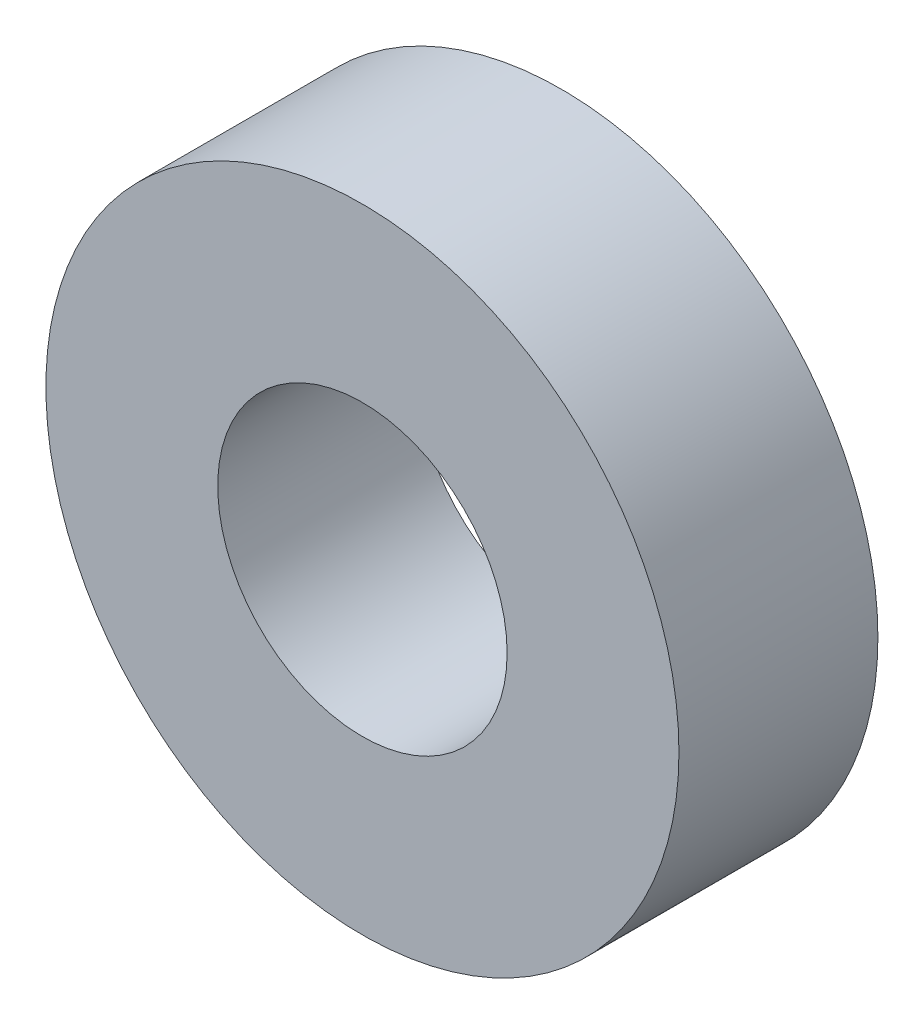
ISO-10303-21;
HEADER;
FILE_DESCRIPTION(('STEP AP214'),'2;1');
FILE_NAME('part.step','',(''),(''),'','','');
FILE_SCHEMA(('AUTOMOTIVE_DESIGN { 1 0 10303 214 1 1 1 1 }'));
ENDSEC;
DATA;
#1=APPLICATION_CONTEXT('core data for automotive mechanical design processes');
#2=APPLICATION_PROTOCOL_DEFINITION('international standard','automotive_design',2000,#1);
#3=PRODUCT_CONTEXT('',#1,'mechanical');
#4=PRODUCT('Part','Part','',(#3));
#5=PRODUCT_RELATED_PRODUCT_CATEGORY('part','',(#4));
#6=PRODUCT_DEFINITION_FORMATION('','',#4);
#7=PRODUCT_DEFINITION_CONTEXT('part definition',#1,'design');
#8=PRODUCT_DEFINITION('design','',#6,#7);
#9=PRODUCT_DEFINITION_SHAPE('','',#8);
#10=(LENGTH_UNIT() NAMED_UNIT(*) SI_UNIT(.MILLI.,.METRE.));
#11=(NAMED_UNIT(*) PLANE_ANGLE_UNIT() SI_UNIT($,.RADIAN.));
#12=(NAMED_UNIT(*) SI_UNIT($,.STERADIAN.) SOLID_ANGLE_UNIT());
#13=UNCERTAINTY_MEASURE_WITH_UNIT(LENGTH_MEASURE(1.E-05),#10,'distance_accuracy_value','');
#14=(GEOMETRIC_REPRESENTATION_CONTEXT(3) GLOBAL_UNCERTAINTY_ASSIGNED_CONTEXT((#13)) GLOBAL_UNIT_ASSIGNED_CONTEXT((#10,
#11,#12)) REPRESENTATION_CONTEXT('',''));
#15=CARTESIAN_POINT('',(0.,0.,0.));
#16=DIRECTION('',(0.,0.,1.));
#17=DIRECTION('',(1.,0.,0.));
#18=AXIS2_PLACEMENT_3D('',#15,#16,#17);
#19=CARTESIAN_POINT('',(0.,0.,11.));
#20=DIRECTION('',(0.,0.,1.));
#21=DIRECTION('',(1.,0.,0.));
#22=AXIS2_PLACEMENT_3D('',#19,#20,#21);
#23=PLANE('',#22);
#24=CARTESIAN_POINT('',(0.,0.,11.));
#25=DIRECTION('',(0.,0.,1.));
#26=DIRECTION('',(1.,0.,0.));
#27=AXIS2_PLACEMENT_3D('',#24,#25,#26);
#28=CIRCLE('',#27,17.5);
#29=CARTESIAN_POINT('',(17.5,0.,11.));
#30=VERTEX_POINT('',#29);
#31=EDGE_CURVE('E10',#30,#30,#28,.T.);
#32=ORIENTED_EDGE('',*,*,#31,.T.);
#33=EDGE_LOOP('',(#32));
#34=FACE_BOUND('',#33,.T.);
#35=CARTESIAN_POINT('',(0.,0.,11.));
#36=DIRECTION('',(0.,0.,1.));
#37=DIRECTION('',(1.,0.,0.));
#38=AXIS2_PLACEMENT_3D('',#35,#36,#37);
#39=CIRCLE('',#38,8.);
#40=CARTESIAN_POINT('',(8.,0.,11.));
#41=VERTEX_POINT('',#40);
#42=EDGE_CURVE('E42',#41,#41,#39,.T.);
#43=ORIENTED_EDGE('',*,*,#42,.F.);
#44=EDGE_LOOP('',(#43));
#45=FACE_BOUND('',#44,.T.);
#46=ADVANCED_FACE('F31',(#34,#45),#23,.T.);
#47=CARTESIAN_POINT('',(0.,0.,0.));
#48=DIRECTION('',(0.,0.,1.));
#49=DIRECTION('',(1.,0.,0.));
#50=AXIS2_PLACEMENT_3D('',#47,#48,#49);
#51=PLANE('',#50);
#52=CARTESIAN_POINT('',(0.,0.,0.));
#53=DIRECTION('',(0.,0.,1.));
#54=DIRECTION('',(1.,0.,0.));
#55=AXIS2_PLACEMENT_3D('',#52,#53,#54);
#56=CIRCLE('',#55,17.5);
#57=CARTESIAN_POINT('',(17.5,0.,0.));
#58=VERTEX_POINT('',#57);
#59=EDGE_CURVE('E35',#58,#58,#56,.T.);
#60=ORIENTED_EDGE('',*,*,#59,.F.);
#61=EDGE_LOOP('',(#60));
#62=FACE_BOUND('',#61,.T.);
#63=CARTESIAN_POINT('',(0.,0.,0.));
#64=DIRECTION('',(0.,0.,1.));
#65=DIRECTION('',(1.,0.,0.));
#66=AXIS2_PLACEMENT_3D('',#63,#64,#65);
#67=CIRCLE('',#66,8.);
#68=CARTESIAN_POINT('',(8.,0.,0.));
#69=VERTEX_POINT('',#68);
#70=EDGE_CURVE('E44',#69,#69,#67,.T.);
#71=ORIENTED_EDGE('',*,*,#70,.T.);
#72=EDGE_LOOP('',(#71));
#73=FACE_BOUND('',#72,.T.);
#74=ADVANCED_FACE('F54',(#62,#73),#51,.F.);
#75=CARTESIAN_POINT('',(0.,0.,11.));
#76=DIRECTION('',(0.,0.,-1.));
#77=DIRECTION('',(-1.,0.,0.));
#78=AXIS2_PLACEMENT_3D('',#75,#76,#77);
#79=CYLINDRICAL_SURFACE('',#78,17.5);
#80=ORIENTED_EDGE('',*,*,#31,.F.);
#81=EDGE_LOOP('',(#80));
#82=FACE_BOUND('',#81,.T.);
#83=ORIENTED_EDGE('',*,*,#59,.T.);
#84=EDGE_LOOP('',(#83));
#85=FACE_BOUND('',#84,.T.);
#86=ADVANCED_FACE('F33',(#82,#85),#79,.T.);
#87=CARTESIAN_POINT('',(0.,0.,11.));
#88=DIRECTION('',(0.,0.,-1.));
#89=DIRECTION('',(-1.,0.,0.));
#90=AXIS2_PLACEMENT_3D('',#87,#88,#89);
#91=CYLINDRICAL_SURFACE('',#90,8.);
#92=ORIENTED_EDGE('',*,*,#42,.T.);
#93=EDGE_LOOP('',(#92));
#94=FACE_BOUND('',#93,.T.);
#95=ORIENTED_EDGE('',*,*,#70,.F.);
#96=EDGE_LOOP('',(#95));
#97=FACE_BOUND('',#96,.T.);
#98=ADVANCED_FACE('F50',(#94,#97),#91,.F.);
#99=CLOSED_SHELL('',(#46,#74,#86,#98));
#100=MANIFOLD_SOLID_BREP('B2',#99);
#101=ADVANCED_BREP_SHAPE_REPRESENTATION('',(#18,#100),#14);
#102=SHAPE_DEFINITION_REPRESENTATION(#9,#101);
ENDSEC;
END-ISO-10303-21;
